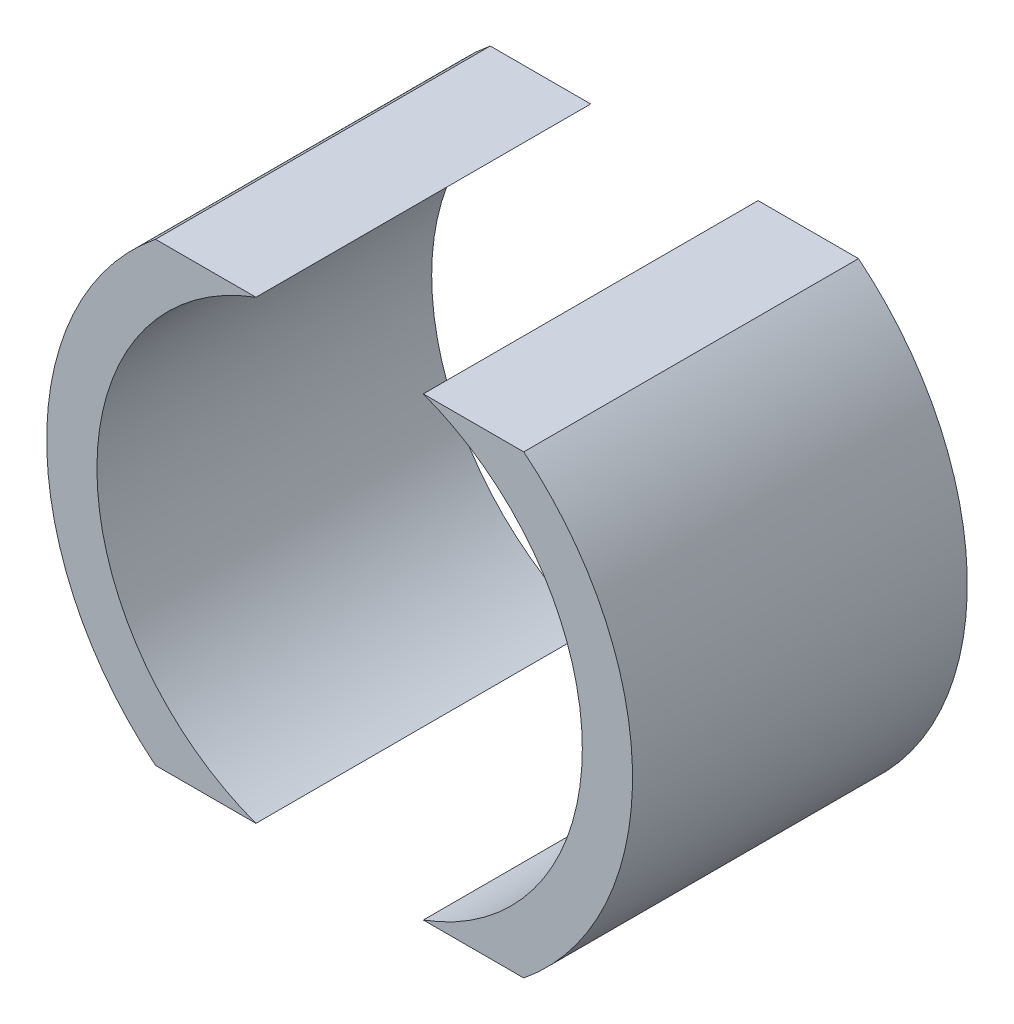
ISO-10303-21;
HEADER;
FILE_DESCRIPTION(('STEP AP214'),'2;1');
FILE_NAME('part.step','',(''),(''),'','','');
FILE_SCHEMA(('AUTOMOTIVE_DESIGN { 1 0 10303 214 1 1 1 1 }'));
ENDSEC;
DATA;
#1=APPLICATION_CONTEXT('core data for automotive mechanical design processes');
#2=APPLICATION_PROTOCOL_DEFINITION('international standard','automotive_design',2000,#1);
#3=PRODUCT_CONTEXT('',#1,'mechanical');
#4=PRODUCT('Part','Part','',(#3));
#5=PRODUCT_RELATED_PRODUCT_CATEGORY('part','',(#4));
#6=PRODUCT_DEFINITION_FORMATION('','',#4);
#7=PRODUCT_DEFINITION_CONTEXT('part definition',#1,'design');
#8=PRODUCT_DEFINITION('design','',#6,#7);
#9=PRODUCT_DEFINITION_SHAPE('','',#8);
#10=(LENGTH_UNIT() NAMED_UNIT(*) SI_UNIT(.MILLI.,.METRE.));
#11=(NAMED_UNIT(*) PLANE_ANGLE_UNIT() SI_UNIT($,.RADIAN.));
#12=(NAMED_UNIT(*) SI_UNIT($,.STERADIAN.) SOLID_ANGLE_UNIT());
#13=UNCERTAINTY_MEASURE_WITH_UNIT(LENGTH_MEASURE(1.E-05),#10,'distance_accuracy_value','');
#14=(GEOMETRIC_REPRESENTATION_CONTEXT(3) GLOBAL_UNCERTAINTY_ASSIGNED_CONTEXT((#13)) GLOBAL_UNIT_ASSIGNED_CONTEXT((#10,
#11,#12)) REPRESENTATION_CONTEXT('',''));
#15=CARTESIAN_POINT('',(0.,0.,0.));
#16=DIRECTION('',(0.,0.,1.));
#17=DIRECTION('',(1.,0.,0.));
#18=AXIS2_PLACEMENT_3D('',#15,#16,#17);
#19=CARTESIAN_POINT('',(0.,0.,20.));
#20=DIRECTION('',(0.,0.,-1.));
#21=DIRECTION('',(-1.,0.,0.));
#22=AXIS2_PLACEMENT_3D('',#19,#20,#21);
#23=CYLINDRICAL_SURFACE('',#22,14.5);
#24=CARTESIAN_POINT('',(0.,0.,0.));
#25=DIRECTION('',(0.,0.,-1.));
#26=DIRECTION('',(1.,0.,0.));
#27=AXIS2_PLACEMENT_3D('',#24,#25,#26);
#28=CIRCLE('',#27,14.5);
#29=CARTESIAN_POINT('',(-5.,-13.6106575888162,0.));
#30=VERTEX_POINT('',#29);
#31=CARTESIAN_POINT('',(-5.,13.6106575888162,0.));
#32=VERTEX_POINT('',#31);
#33=EDGE_CURVE('E107',#30,#32,#28,.T.);
#34=ORIENTED_EDGE('',*,*,#33,.T.);
#35=DIRECTION('',(0.,0.,-1.));
#36=VECTOR('',#35,1.);
#37=CARTESIAN_POINT('',(-5.,13.6106575888162,20.));
#38=LINE('',#37,#36);
#39=CARTESIAN_POINT('',(-5.,13.6106575888162,20.));
#40=VERTEX_POINT('',#39);
#41=EDGE_CURVE('E12',#40,#32,#38,.T.);
#42=ORIENTED_EDGE('',*,*,#41,.F.);
#43=CARTESIAN_POINT('',(0.,0.,20.));
#44=DIRECTION('',(0.,0.,-1.));
#45=DIRECTION('',(1.,0.,0.));
#46=AXIS2_PLACEMENT_3D('',#43,#44,#45);
#47=CIRCLE('',#46,14.5);
#48=CARTESIAN_POINT('',(-5.,-13.6106575888162,20.));
#49=VERTEX_POINT('',#48);
#50=EDGE_CURVE('E95',#49,#40,#47,.T.);
#51=ORIENTED_EDGE('',*,*,#50,.F.);
#52=DIRECTION('',(0.,0.,-1.));
#53=VECTOR('',#52,1.);
#54=CARTESIAN_POINT('',(-5.,-13.6106575888162,20.));
#55=LINE('',#54,#53);
#56=EDGE_CURVE('E103',#49,#30,#55,.T.);
#57=ORIENTED_EDGE('',*,*,#56,.T.);
#58=EDGE_LOOP('',(#34,#42,#51,#57));
#59=FACE_BOUND('',#58,.T.);
#60=ADVANCED_FACE('F44',(#59),#23,.F.);
#61=CARTESIAN_POINT('',(-5.,13.6106575888162,20.));
#62=DIRECTION('',(0.,-1.,0.));
#63=DIRECTION('',(1.,0.,0.));
#64=AXIS2_PLACEMENT_3D('',#61,#62,#63);
#65=PLANE('',#64);
#66=DIRECTION('',(-1.,0.,0.));
#67=VECTOR('',#66,1.);
#68=CARTESIAN_POINT('',(-5.,13.6106575888162,0.));
#69=LINE('',#68,#67);
#70=CARTESIAN_POINT('',(-11.,13.6106575888162,0.));
#71=VERTEX_POINT('',#70);
#72=EDGE_CURVE('E99',#32,#71,#69,.T.);
#73=ORIENTED_EDGE('',*,*,#72,.T.);
#74=DIRECTION('',(0.,0.,-1.));
#75=VECTOR('',#74,1.);
#76=CARTESIAN_POINT('',(-11.,13.6106575888162,20.));
#77=LINE('',#76,#75);
#78=CARTESIAN_POINT('',(-11.,13.6106575888162,20.));
#79=VERTEX_POINT('',#78);
#80=EDGE_CURVE('E52',#79,#71,#77,.T.);
#81=ORIENTED_EDGE('',*,*,#80,.F.);
#82=DIRECTION('',(-1.,0.,0.));
#83=VECTOR('',#82,1.);
#84=CARTESIAN_POINT('',(-5.,13.6106575888162,20.));
#85=LINE('',#84,#83);
#86=EDGE_CURVE('E90',#40,#79,#85,.T.);
#87=ORIENTED_EDGE('',*,*,#86,.F.);
#88=ORIENTED_EDGE('',*,*,#41,.T.);
#89=EDGE_LOOP('',(#73,#81,#87,#88));
#90=FACE_BOUND('',#89,.T.);
#91=ADVANCED_FACE('F98',(#90),#65,.F.);
#92=CARTESIAN_POINT('',(0.,0.,20.));
#93=DIRECTION('',(0.,0.,-1.));
#94=DIRECTION('',(-1.,0.,0.));
#95=AXIS2_PLACEMENT_3D('',#92,#93,#94);
#96=CYLINDRICAL_SURFACE('',#95,17.5);
#97=CARTESIAN_POINT('',(0.,0.,0.));
#98=DIRECTION('',(0.,0.,1.));
#99=DIRECTION('',(1.,0.,0.));
#100=AXIS2_PLACEMENT_3D('',#97,#98,#99);
#101=CIRCLE('',#100,17.5);
#102=CARTESIAN_POINT('',(-11.,-13.6106575888162,0.));
#103=VERTEX_POINT('',#102);
#104=EDGE_CURVE('E77',#71,#103,#101,.T.);
#105=ORIENTED_EDGE('',*,*,#104,.T.);
#106=DIRECTION('',(0.,0.,-1.));
#107=VECTOR('',#106,1.);
#108=CARTESIAN_POINT('',(-11.,-13.6106575888162,20.));
#109=LINE('',#108,#107);
#110=CARTESIAN_POINT('',(-11.,-13.6106575888162,20.));
#111=VERTEX_POINT('',#110);
#112=EDGE_CURVE('E100',#111,#103,#109,.T.);
#113=ORIENTED_EDGE('',*,*,#112,.F.);
#114=CARTESIAN_POINT('',(0.,0.,20.));
#115=DIRECTION('',(0.,0.,1.));
#116=DIRECTION('',(1.,0.,0.));
#117=AXIS2_PLACEMENT_3D('',#114,#115,#116);
#118=CIRCLE('',#117,17.5);
#119=EDGE_CURVE('E93',#79,#111,#118,.T.);
#120=ORIENTED_EDGE('',*,*,#119,.F.);
#121=ORIENTED_EDGE('',*,*,#80,.T.);
#122=EDGE_LOOP('',(#105,#113,#120,#121));
#123=FACE_BOUND('',#122,.T.);
#124=ADVANCED_FACE('F101',(#123),#96,.T.);
#125=CARTESIAN_POINT('',(-5.,-13.6106575888162,20.));
#126=DIRECTION('',(0.,1.,0.));
#127=DIRECTION('',(-1.,0.,0.));
#128=AXIS2_PLACEMENT_3D('',#125,#126,#127);
#129=PLANE('',#128);
#130=DIRECTION('',(1.,0.,0.));
#131=VECTOR('',#130,1.);
#132=CARTESIAN_POINT('',(-5.,-13.6106575888162,0.));
#133=LINE('',#132,#131);
#134=EDGE_CURVE('E83',#103,#30,#133,.T.);
#135=ORIENTED_EDGE('',*,*,#134,.T.);
#136=ORIENTED_EDGE('',*,*,#56,.F.);
#137=DIRECTION('',(1.,0.,0.));
#138=VECTOR('',#137,1.);
#139=CARTESIAN_POINT('',(-5.,-13.6106575888162,20.));
#140=LINE('',#139,#138);
#141=EDGE_CURVE('E60',#111,#49,#140,.T.);
#142=ORIENTED_EDGE('',*,*,#141,.F.);
#143=ORIENTED_EDGE('',*,*,#112,.T.);
#144=EDGE_LOOP('',(#135,#136,#142,#143));
#145=FACE_BOUND('',#144,.T.);
#146=ADVANCED_FACE('F114',(#145),#129,.F.);
#147=CARTESIAN_POINT('',(0.,0.,20.));
#148=DIRECTION('',(0.,0.,1.));
#149=DIRECTION('',(1.,0.,0.));
#150=AXIS2_PLACEMENT_3D('',#147,#148,#149);
#151=PLANE('',#150);
#152=ORIENTED_EDGE('',*,*,#50,.T.);
#153=ORIENTED_EDGE('',*,*,#86,.T.);
#154=ORIENTED_EDGE('',*,*,#119,.T.);
#155=ORIENTED_EDGE('',*,*,#141,.T.);
#156=EDGE_LOOP('',(#152,#153,#154,#155));
#157=FACE_BOUND('',#156,.T.);
#158=ADVANCED_FACE('F91',(#157),#151,.T.);
#159=CARTESIAN_POINT('',(0.,0.,0.));
#160=DIRECTION('',(0.,0.,1.));
#161=DIRECTION('',(1.,0.,0.));
#162=AXIS2_PLACEMENT_3D('',#159,#160,#161);
#163=PLANE('',#162);
#164=ORIENTED_EDGE('',*,*,#33,.F.);
#165=ORIENTED_EDGE('',*,*,#134,.F.);
#166=ORIENTED_EDGE('',*,*,#104,.F.);
#167=ORIENTED_EDGE('',*,*,#72,.F.);
#168=EDGE_LOOP('',(#164,#165,#166,#167));
#169=FACE_BOUND('',#168,.T.);
#170=ADVANCED_FACE('F117',(#169),#163,.F.);
#171=CLOSED_SHELL('',(#60,#91,#124,#146,#158,#170));
#172=MANIFOLD_SOLID_BREP('B2',#171);
#173=CARTESIAN_POINT('',(0.,0.,20.));
#174=DIRECTION('',(0.,0.,-1.));
#175=DIRECTION('',(-1.,0.,0.));
#176=AXIS2_PLACEMENT_3D('',#173,#174,#175);
#177=CYLINDRICAL_SURFACE('',#176,17.5);
#178=CARTESIAN_POINT('',(0.,0.,0.));
#179=DIRECTION('',(0.,0.,1.));
#180=DIRECTION('',(1.,0.,0.));
#181=AXIS2_PLACEMENT_3D('',#178,#179,#180);
#182=CIRCLE('',#181,17.5);
#183=CARTESIAN_POINT('',(11.,-13.6106575888162,0.));
#184=VERTEX_POINT('',#183);
#185=CARTESIAN_POINT('',(11.,13.6106575888162,0.));
#186=VERTEX_POINT('',#185);
#187=EDGE_CURVE('E230',#184,#186,#182,.T.);
#188=ORIENTED_EDGE('',*,*,#187,.T.);
#189=DIRECTION('',(0.,0.,-1.));
#190=VECTOR('',#189,1.);
#191=CARTESIAN_POINT('',(11.,13.6106575888162,20.));
#192=LINE('',#191,#190);
#193=CARTESIAN_POINT('',(11.,13.6106575888162,20.));
#194=VERTEX_POINT('',#193);
#195=EDGE_CURVE('E42',#194,#186,#192,.T.);
#196=ORIENTED_EDGE('',*,*,#195,.F.);
#197=CARTESIAN_POINT('',(0.,0.,20.));
#198=DIRECTION('',(0.,0.,1.));
#199=DIRECTION('',(1.,0.,0.));
#200=AXIS2_PLACEMENT_3D('',#197,#198,#199);
#201=CIRCLE('',#200,17.5);
#202=CARTESIAN_POINT('',(11.,-13.6106575888162,20.));
#203=VERTEX_POINT('',#202);
#204=EDGE_CURVE('E218',#203,#194,#201,.T.);
#205=ORIENTED_EDGE('',*,*,#204,.F.);
#206=DIRECTION('',(0.,0.,-1.));
#207=VECTOR('',#206,1.);
#208=CARTESIAN_POINT('',(11.,-13.6106575888162,20.));
#209=LINE('',#208,#207);
#210=EDGE_CURVE('E226',#203,#184,#209,.T.);
#211=ORIENTED_EDGE('',*,*,#210,.T.);
#212=EDGE_LOOP('',(#188,#196,#205,#211));
#213=FACE_BOUND('',#212,.T.);
#214=ADVANCED_FACE('F167',(#213),#177,.T.);
#215=CARTESIAN_POINT('',(5.,13.6106575888162,20.));
#216=DIRECTION('',(0.,-1.,0.));
#217=DIRECTION('',(0.,0.,-1.));
#218=AXIS2_PLACEMENT_3D('',#215,#216,#217);
#219=PLANE('',#218);
#220=DIRECTION('',(-1.,0.,0.));
#221=VECTOR('',#220,1.);
#222=CARTESIAN_POINT('',(5.,13.6106575888162,0.));
#223=LINE('',#222,#221);
#224=CARTESIAN_POINT('',(5.,13.6106575888162,0.));
#225=VERTEX_POINT('',#224);
#226=EDGE_CURVE('E222',#186,#225,#223,.T.);
#227=ORIENTED_EDGE('',*,*,#226,.T.);
#228=DIRECTION('',(0.,0.,-1.));
#229=VECTOR('',#228,1.);
#230=CARTESIAN_POINT('',(5.,13.6106575888162,20.));
#231=LINE('',#230,#229);
#232=CARTESIAN_POINT('',(5.,13.6106575888162,20.));
#233=VERTEX_POINT('',#232);
#234=EDGE_CURVE('E175',#233,#225,#231,.T.);
#235=ORIENTED_EDGE('',*,*,#234,.F.);
#236=DIRECTION('',(-1.,0.,0.));
#237=VECTOR('',#236,1.);
#238=CARTESIAN_POINT('',(5.,13.6106575888162,20.));
#239=LINE('',#238,#237);
#240=EDGE_CURVE('E213',#194,#233,#239,.T.);
#241=ORIENTED_EDGE('',*,*,#240,.F.);
#242=ORIENTED_EDGE('',*,*,#195,.T.);
#243=EDGE_LOOP('',(#227,#235,#241,#242));
#244=FACE_BOUND('',#243,.T.);
#245=ADVANCED_FACE('F221',(#244),#219,.F.);
#246=CARTESIAN_POINT('',(0.,0.,20.));
#247=DIRECTION('',(0.,0.,-1.));
#248=DIRECTION('',(-1.,0.,0.));
#249=AXIS2_PLACEMENT_3D('',#246,#247,#248);
#250=CYLINDRICAL_SURFACE('',#249,14.5);
#251=CARTESIAN_POINT('',(0.,0.,0.));
#252=DIRECTION('',(0.,0.,-1.));
#253=DIRECTION('',(1.,0.,0.));
#254=AXIS2_PLACEMENT_3D('',#251,#252,#253);
#255=CIRCLE('',#254,14.5);
#256=CARTESIAN_POINT('',(5.,-13.6106575888162,0.));
#257=VERTEX_POINT('',#256);
#258=EDGE_CURVE('E200',#225,#257,#255,.T.);
#259=ORIENTED_EDGE('',*,*,#258,.T.);
#260=DIRECTION('',(0.,0.,-1.));
#261=VECTOR('',#260,1.);
#262=CARTESIAN_POINT('',(5.,-13.6106575888162,20.));
#263=LINE('',#262,#261);
#264=CARTESIAN_POINT('',(5.,-13.6106575888162,20.));
#265=VERTEX_POINT('',#264);
#266=EDGE_CURVE('E223',#265,#257,#263,.T.);
#267=ORIENTED_EDGE('',*,*,#266,.F.);
#268=CARTESIAN_POINT('',(0.,0.,20.));
#269=DIRECTION('',(0.,0.,-1.));
#270=DIRECTION('',(1.,0.,0.));
#271=AXIS2_PLACEMENT_3D('',#268,#269,#270);
#272=CIRCLE('',#271,14.5);
#273=EDGE_CURVE('E216',#233,#265,#272,.T.);
#274=ORIENTED_EDGE('',*,*,#273,.F.);
#275=ORIENTED_EDGE('',*,*,#234,.T.);
#276=EDGE_LOOP('',(#259,#267,#274,#275));
#277=FACE_BOUND('',#276,.T.);
#278=ADVANCED_FACE('F224',(#277),#250,.F.);
#279=CARTESIAN_POINT('',(5.,-13.6106575888162,20.));
#280=DIRECTION('',(0.,1.,0.));
#281=DIRECTION('',(0.,0.,1.));
#282=AXIS2_PLACEMENT_3D('',#279,#280,#281);
#283=PLANE('',#282);
#284=DIRECTION('',(1.,0.,0.));
#285=VECTOR('',#284,1.);
#286=CARTESIAN_POINT('',(5.,-13.6106575888162,0.));
#287=LINE('',#286,#285);
#288=EDGE_CURVE('E206',#257,#184,#287,.T.);
#289=ORIENTED_EDGE('',*,*,#288,.T.);
#290=ORIENTED_EDGE('',*,*,#210,.F.);
#291=DIRECTION('',(1.,0.,0.));
#292=VECTOR('',#291,1.);
#293=CARTESIAN_POINT('',(5.,-13.6106575888162,20.));
#294=LINE('',#293,#292);
#295=EDGE_CURVE('E183',#265,#203,#294,.T.);
#296=ORIENTED_EDGE('',*,*,#295,.F.);
#297=ORIENTED_EDGE('',*,*,#266,.T.);
#298=EDGE_LOOP('',(#289,#290,#296,#297));
#299=FACE_BOUND('',#298,.T.);
#300=ADVANCED_FACE('F237',(#299),#283,.F.);
#301=CARTESIAN_POINT('',(0.,0.,20.));
#302=DIRECTION('',(0.,0.,1.));
#303=DIRECTION('',(1.,0.,0.));
#304=AXIS2_PLACEMENT_3D('',#301,#302,#303);
#305=PLANE('',#304);
#306=ORIENTED_EDGE('',*,*,#204,.T.);
#307=ORIENTED_EDGE('',*,*,#240,.T.);
#308=ORIENTED_EDGE('',*,*,#273,.T.);
#309=ORIENTED_EDGE('',*,*,#295,.T.);
#310=EDGE_LOOP('',(#306,#307,#308,#309));
#311=FACE_BOUND('',#310,.T.);
#312=ADVANCED_FACE('F214',(#311),#305,.T.);
#313=CARTESIAN_POINT('',(0.,0.,0.));
#314=DIRECTION('',(0.,0.,1.));
#315=DIRECTION('',(1.,0.,0.));
#316=AXIS2_PLACEMENT_3D('',#313,#314,#315);
#317=PLANE('',#316);
#318=ORIENTED_EDGE('',*,*,#187,.F.);
#319=ORIENTED_EDGE('',*,*,#288,.F.);
#320=ORIENTED_EDGE('',*,*,#258,.F.);
#321=ORIENTED_EDGE('',*,*,#226,.F.);
#322=EDGE_LOOP('',(#318,#319,#320,#321));
#323=FACE_BOUND('',#322,.T.);
#324=ADVANCED_FACE('F240',(#323),#317,.F.);
#325=CLOSED_SHELL('',(#214,#245,#278,#300,#312,#324));
#326=MANIFOLD_SOLID_BREP('B6',#325);
#327=ADVANCED_BREP_SHAPE_REPRESENTATION('',(#18,#172,#326),#14);
#328=SHAPE_DEFINITION_REPRESENTATION(#9,#327);
ENDSEC;
END-ISO-10303-21;
